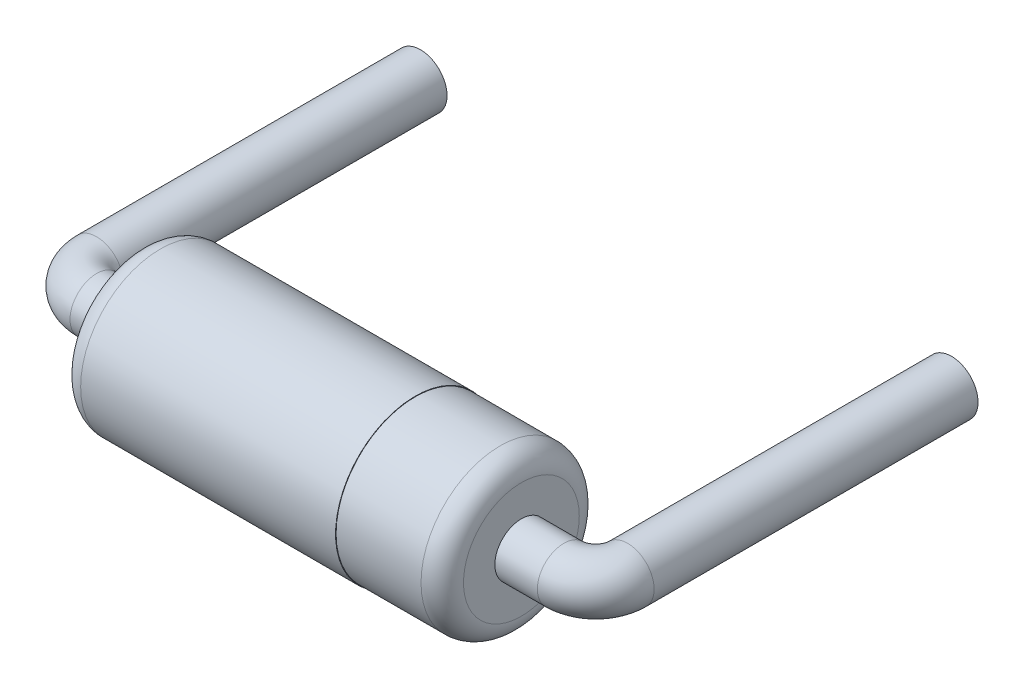
ISO-10303-21;
HEADER;
FILE_DESCRIPTION(('STEP AP214'),'2;1');
FILE_NAME('part.step','',(''),(''),'','','');
FILE_SCHEMA(('AUTOMOTIVE_DESIGN { 1 0 10303 214 1 1 1 1 }'));
ENDSEC;
DATA;
#1=APPLICATION_CONTEXT('core data for automotive mechanical design processes');
#2=APPLICATION_PROTOCOL_DEFINITION('international standard','automotive_design',2000,#1);
#3=PRODUCT_CONTEXT('',#1,'mechanical');
#4=PRODUCT('Part','Part','',(#3));
#5=PRODUCT_RELATED_PRODUCT_CATEGORY('part','',(#4));
#6=PRODUCT_DEFINITION_FORMATION('','',#4);
#7=PRODUCT_DEFINITION_CONTEXT('part definition',#1,'design');
#8=PRODUCT_DEFINITION('design','',#6,#7);
#9=PRODUCT_DEFINITION_SHAPE('','',#8);
#10=(LENGTH_UNIT() NAMED_UNIT(*) SI_UNIT(.MILLI.,.METRE.));
#11=(NAMED_UNIT(*) PLANE_ANGLE_UNIT() SI_UNIT($,.RADIAN.));
#12=(NAMED_UNIT(*) SI_UNIT($,.STERADIAN.) SOLID_ANGLE_UNIT());
#13=UNCERTAINTY_MEASURE_WITH_UNIT(LENGTH_MEASURE(1.E-05),#10,'distance_accuracy_value','');
#14=(GEOMETRIC_REPRESENTATION_CONTEXT(3) GLOBAL_UNCERTAINTY_ASSIGNED_CONTEXT((#13)) GLOBAL_UNIT_ASSIGNED_CONTEXT((#10,
#11,#12)) REPRESENTATION_CONTEXT('',''));
#15=CARTESIAN_POINT('',(0.,0.,0.));
#16=DIRECTION('',(0.,0.,1.));
#17=DIRECTION('',(1.,0.,0.));
#18=AXIS2_PLACEMENT_3D('',#15,#16,#17);
#19=CARTESIAN_POINT('',(2.5,0.,-3.35));
#20=DIRECTION('',(0.,0.,1.));
#21=DIRECTION('',(1.,0.,0.));
#22=AXIS2_PLACEMENT_3D('',#19,#20,#21);
#23=PLANE('',#22);
#24=CARTESIAN_POINT('',(2.5,0.,-3.35));
#25=DIRECTION('',(0.,0.,-1.));
#26=DIRECTION('',(-1.,0.,0.));
#27=AXIS2_PLACEMENT_3D('',#24,#25,#26);
#28=CIRCLE('',#27,0.25);
#29=CARTESIAN_POINT('',(2.25,0.,-3.35));
#30=VERTEX_POINT('',#29);
#31=EDGE_CURVE('E19',#30,#30,#28,.F.);
#32=ORIENTED_EDGE('',*,*,#31,.F.);
#33=EDGE_LOOP('',(#32));
#34=FACE_BOUND('',#33,.T.);
#35=ADVANCED_FACE('F15',(#34),#23,.F.);
#36=CARTESIAN_POINT('',(2.5,0.,-3.35));
#37=DIRECTION('',(0.,0.,-1.));
#38=DIRECTION('',(-1.,0.,0.));
#39=AXIS2_PLACEMENT_3D('',#36,#37,#38);
#40=CYLINDRICAL_SURFACE('',#39,0.25);
#41=ORIENTED_EDGE('',*,*,#31,.T.);
#42=EDGE_LOOP('',(#41));
#43=FACE_BOUND('',#42,.T.);
#44=CARTESIAN_POINT('',(2.5,0.,-0.3));
#45=DIRECTION('',(0.,0.,1.));
#46=DIRECTION('',(-1.,0.,0.));
#47=AXIS2_PLACEMENT_3D('',#44,#45,#46);
#48=CIRCLE('',#47,0.25);
#49=CARTESIAN_POINT('',(2.75,0.,-0.3));
#50=VERTEX_POINT('',#49);
#51=EDGE_CURVE('E32',#50,#50,#48,.T.);
#52=ORIENTED_EDGE('',*,*,#51,.F.);
#53=EDGE_LOOP('',(#52));
#54=FACE_BOUND('',#53,.T.);
#55=ADVANCED_FACE('F62',(#43,#54),#40,.T.);
#56=CARTESIAN_POINT('',(-2.5,0.,-3.35));
#57=DIRECTION('',(0.,0.,-1.));
#58=DIRECTION('',(-1.,0.,0.));
#59=AXIS2_PLACEMENT_3D('',#56,#57,#58);
#60=PLANE('',#59);
#61=CARTESIAN_POINT('',(-2.5,0.,-3.35));
#62=DIRECTION('',(0.,0.,1.));
#63=DIRECTION('',(1.,0.,0.));
#64=AXIS2_PLACEMENT_3D('',#61,#62,#63);
#65=CIRCLE('',#64,0.25);
#66=CARTESIAN_POINT('',(-2.25,0.,-3.35));
#67=VERTEX_POINT('',#66);
#68=EDGE_CURVE('E50',#67,#67,#65,.T.);
#69=ORIENTED_EDGE('',*,*,#68,.F.);
#70=EDGE_LOOP('',(#69));
#71=FACE_BOUND('',#70,.T.);
#72=ADVANCED_FACE('F71',(#71),#60,.T.);
#73=CARTESIAN_POINT('',(2.2,0.,-0.3));
#74=DIRECTION('',(0.,1.,0.));
#75=DIRECTION('',(0.,0.,1.));
#76=AXIS2_PLACEMENT_3D('',#73,#74,#75);
#77=TOROIDAL_SURFACE('',#76,0.3,0.25);
#78=CARTESIAN_POINT('',(2.2,0.,0.));
#79=DIRECTION('',(1.,0.,0.));
#80=DIRECTION('',(0.,0.,-1.));
#81=AXIS2_PLACEMENT_3D('',#78,#79,#80);
#82=CIRCLE('',#81,0.25);
#83=CARTESIAN_POINT('',(2.2,0.,0.25));
#84=VERTEX_POINT('',#83);
#85=EDGE_CURVE('E52',#84,#84,#82,.F.);
#86=CARTESIAN_POINT('',(2.2,0.,-0.3));
#87=DIRECTION('',(0.,1.,0.));
#88=DIRECTION('',(0.,0.,1.));
#89=AXIS2_PLACEMENT_3D('',#86,#87,#88);
#90=CIRCLE('',#89,0.55);
#91=EDGE_CURVE('',#84,#50,#90,.T.);
#92=ORIENTED_EDGE('',*,*,#85,.F.);
#93=ORIENTED_EDGE('',*,*,#51,.T.);
#94=ORIENTED_EDGE('',*,*,#91,.T.);
#95=ORIENTED_EDGE('',*,*,#91,.F.);
#96=EDGE_LOOP('',(#92,#94,#93,#95));
#97=FACE_BOUND('',#96,.T.);
#98=ADVANCED_FACE('F110',(#97),#77,.T.);
#99=CARTESIAN_POINT('',(-2.5,0.,-3.35));
#100=DIRECTION('',(0.,0.,1.));
#101=DIRECTION('',(1.,0.,0.));
#102=AXIS2_PLACEMENT_3D('',#99,#100,#101);
#103=CYLINDRICAL_SURFACE('',#102,0.25);
#104=ORIENTED_EDGE('',*,*,#68,.T.);
#105=EDGE_LOOP('',(#104));
#106=FACE_BOUND('',#105,.T.);
#107=CARTESIAN_POINT('',(-2.5,0.,-0.3));
#108=DIRECTION('',(0.,0.,1.));
#109=DIRECTION('',(-1.,0.,0.));
#110=AXIS2_PLACEMENT_3D('',#107,#108,#109);
#111=CIRCLE('',#110,0.25);
#112=CARTESIAN_POINT('',(-2.75,0.,-0.300000000000001));
#113=VERTEX_POINT('',#112);
#114=EDGE_CURVE('E49',#113,#113,#111,.T.);
#115=ORIENTED_EDGE('',*,*,#114,.F.);
#116=EDGE_LOOP('',(#115));
#117=FACE_BOUND('',#116,.T.);
#118=ADVANCED_FACE('F106',(#106,#117),#103,.T.);
#119=CARTESIAN_POINT('',(2.2,0.,0.));
#120=DIRECTION('',(1.,0.,0.));
#121=DIRECTION('',(0.,0.,-1.));
#122=AXIS2_PLACEMENT_3D('',#119,#120,#121);
#123=CYLINDRICAL_SURFACE('',#122,0.25);
#124=ORIENTED_EDGE('',*,*,#85,.T.);
#125=EDGE_LOOP('',(#124));
#126=FACE_BOUND('',#125,.T.);
#127=CARTESIAN_POINT('',(1.8,0.,0.));
#128=DIRECTION('',(1.,0.,0.));
#129=DIRECTION('',(0.,0.,-1.));
#130=AXIS2_PLACEMENT_3D('',#127,#128,#129);
#131=CIRCLE('',#130,0.25);
#132=CARTESIAN_POINT('',(1.8,0.,-0.250000000000002));
#133=VERTEX_POINT('',#132);
#134=EDGE_CURVE('E47',#133,#133,#131,.T.);
#135=ORIENTED_EDGE('',*,*,#134,.T.);
#136=EDGE_LOOP('',(#135));
#137=FACE_BOUND('',#136,.T.);
#138=ADVANCED_FACE('F103',(#126,#137),#123,.T.);
#139=CARTESIAN_POINT('',(-2.2,0.,-0.299999999999999));
#140=DIRECTION('',(0.,1.,0.));
#141=DIRECTION('',(0.,0.,1.));
#142=AXIS2_PLACEMENT_3D('',#139,#140,#141);
#143=TOROIDAL_SURFACE('',#142,0.3,0.25);
#144=CARTESIAN_POINT('',(-2.2,0.,0.));
#145=DIRECTION('',(1.,0.,0.));
#146=DIRECTION('',(0.,0.,-1.));
#147=AXIS2_PLACEMENT_3D('',#144,#145,#146);
#148=CIRCLE('',#147,0.25);
#149=CARTESIAN_POINT('',(-2.2,0.,0.25));
#150=VERTEX_POINT('',#149);
#151=EDGE_CURVE('E46',#150,#150,#148,.T.);
#152=CARTESIAN_POINT('',(-2.2,0.,-0.299999999999999));
#153=DIRECTION('',(0.,1.,0.));
#154=DIRECTION('',(0.,0.,1.));
#155=AXIS2_PLACEMENT_3D('',#152,#153,#154);
#156=CIRCLE('',#155,0.55);
#157=EDGE_CURVE('',#113,#150,#156,.T.);
#158=ORIENTED_EDGE('',*,*,#114,.T.);
#159=ORIENTED_EDGE('',*,*,#151,.F.);
#160=ORIENTED_EDGE('',*,*,#157,.T.);
#161=ORIENTED_EDGE('',*,*,#157,.F.);
#162=EDGE_LOOP('',(#158,#160,#159,#161));
#163=FACE_BOUND('',#162,.T.);
#164=ADVANCED_FACE('F101',(#163),#143,.T.);
#165=CARTESIAN_POINT('',(1.8,0.375,0.));
#166=DIRECTION('',(-1.,0.,0.));
#167=DIRECTION('',(0.,0.,1.));
#168=AXIS2_PLACEMENT_3D('',#165,#166,#167);
#169=PLANE('',#168);
#170=CARTESIAN_POINT('',(1.8,0.,0.));
#171=DIRECTION('',(1.,0.,0.));
#172=DIRECTION('',(0.,0.,-1.));
#173=AXIS2_PLACEMENT_3D('',#170,#171,#172);
#174=CIRCLE('',#173,0.545);
#175=CARTESIAN_POINT('',(1.8,0.,-0.545));
#176=VERTEX_POINT('',#175);
#177=EDGE_CURVE('E43',#176,#176,#174,.F.);
#178=ORIENTED_EDGE('',*,*,#177,.F.);
#179=EDGE_LOOP('',(#178));
#180=FACE_BOUND('',#179,.T.);
#181=ORIENTED_EDGE('',*,*,#134,.F.);
#182=EDGE_LOOP('',(#181));
#183=FACE_BOUND('',#182,.T.);
#184=ADVANCED_FACE('F97',(#180,#183),#169,.F.);
#185=CARTESIAN_POINT('',(-2.2,0.,0.));
#186=DIRECTION('',(1.,0.,0.));
#187=DIRECTION('',(0.,0.,-1.));
#188=AXIS2_PLACEMENT_3D('',#185,#186,#187);
#189=CYLINDRICAL_SURFACE('',#188,0.25);
#190=ORIENTED_EDGE('',*,*,#151,.T.);
#191=EDGE_LOOP('',(#190));
#192=FACE_BOUND('',#191,.T.);
#193=CARTESIAN_POINT('',(-1.8,0.,0.));
#194=DIRECTION('',(1.,0.,0.));
#195=DIRECTION('',(0.,0.,-1.));
#196=AXIS2_PLACEMENT_3D('',#193,#194,#195);
#197=CIRCLE('',#196,0.25);
#198=CARTESIAN_POINT('',(-1.8,0.,-0.250000000000002));
#199=VERTEX_POINT('',#198);
#200=EDGE_CURVE('E40',#199,#199,#197,.T.);
#201=ORIENTED_EDGE('',*,*,#200,.F.);
#202=EDGE_LOOP('',(#201));
#203=FACE_BOUND('',#202,.T.);
#204=ADVANCED_FACE('F94',(#192,#203),#189,.T.);
#205=CARTESIAN_POINT('',(1.6,0.,0.));
#206=DIRECTION('',(1.,0.,0.));
#207=DIRECTION('',(0.,0.,-1.));
#208=AXIS2_PLACEMENT_3D('',#205,#206,#207);
#209=TOROIDAL_SURFACE('',#208,0.545,0.2);
#210=CARTESIAN_POINT('',(1.6,0.,0.));
#211=DIRECTION('',(-1.,0.,0.));
#212=DIRECTION('',(0.,0.,1.));
#213=AXIS2_PLACEMENT_3D('',#210,#211,#212);
#214=CIRCLE('',#213,0.745);
#215=CARTESIAN_POINT('',(1.6,0.,0.745));
#216=VERTEX_POINT('',#215);
#217=EDGE_CURVE('E39',#216,#216,#214,.T.);
#218=ORIENTED_EDGE('',*,*,#217,.F.);
#219=EDGE_LOOP('',(#218));
#220=FACE_BOUND('',#219,.T.);
#221=ORIENTED_EDGE('',*,*,#177,.T.);
#222=EDGE_LOOP('',(#221));
#223=FACE_BOUND('',#222,.T.);
#224=ADVANCED_FACE('F92',(#220,#223),#209,.T.);
#225=CARTESIAN_POINT('',(-1.8,0.375,0.));
#226=DIRECTION('',(-1.,0.,0.));
#227=DIRECTION('',(0.,0.,1.));
#228=AXIS2_PLACEMENT_3D('',#225,#226,#227);
#229=PLANE('',#228);
#230=CARTESIAN_POINT('',(-1.8,0.,0.));
#231=DIRECTION('',(1.,0.,0.));
#232=DIRECTION('',(0.,1.,0.));
#233=AXIS2_PLACEMENT_3D('',#230,#231,#232);
#234=CIRCLE('',#233,0.55);
#235=CARTESIAN_POINT('',(-1.8,0.55,0.));
#236=VERTEX_POINT('',#235);
#237=EDGE_CURVE('E36',#236,#236,#234,.T.);
#238=ORIENTED_EDGE('',*,*,#237,.F.);
#239=EDGE_LOOP('',(#238));
#240=FACE_BOUND('',#239,.T.);
#241=ORIENTED_EDGE('',*,*,#200,.T.);
#242=EDGE_LOOP('',(#241));
#243=FACE_BOUND('',#242,.T.);
#244=ADVANCED_FACE('F88',(#240,#243),#229,.T.);
#245=CARTESIAN_POINT('',(1.8,0.,0.));
#246=DIRECTION('',(-1.,0.,0.));
#247=DIRECTION('',(0.,0.,1.));
#248=AXIS2_PLACEMENT_3D('',#245,#246,#247);
#249=CYLINDRICAL_SURFACE('',#248,0.745);
#250=ORIENTED_EDGE('',*,*,#217,.T.);
#251=EDGE_LOOP('',(#250));
#252=FACE_BOUND('',#251,.T.);
#253=CARTESIAN_POINT('',(0.8,0.,0.));
#254=DIRECTION('',(-1.,0.,0.));
#255=DIRECTION('',(0.,0.,1.));
#256=AXIS2_PLACEMENT_3D('',#253,#254,#255);
#257=CIRCLE('',#256,0.745);
#258=CARTESIAN_POINT('',(0.8,0.,0.745));
#259=VERTEX_POINT('',#258);
#260=EDGE_CURVE('E28',#259,#259,#257,.F.);
#261=ORIENTED_EDGE('',*,*,#260,.T.);
#262=EDGE_LOOP('',(#261));
#263=FACE_BOUND('',#262,.T.);
#264=ADVANCED_FACE('F85',(#252,#263),#249,.T.);
#265=CARTESIAN_POINT('',(-1.6,0.,0.));
#266=DIRECTION('',(1.,0.,0.));
#267=DIRECTION('',(0.,1.,0.));
#268=AXIS2_PLACEMENT_3D('',#265,#266,#267);
#269=TOROIDAL_SURFACE('',#268,0.55,0.2);
#270=CARTESIAN_POINT('',(-1.6,0.,0.));
#271=DIRECTION('',(1.,0.,0.));
#272=DIRECTION('',(0.,0.,-1.));
#273=AXIS2_PLACEMENT_3D('',#270,#271,#272);
#274=CIRCLE('',#273,0.75);
#275=CARTESIAN_POINT('',(-1.6,0.,-0.75));
#276=VERTEX_POINT('',#275);
#277=EDGE_CURVE('E23',#276,#276,#274,.T.);
#278=ORIENTED_EDGE('',*,*,#277,.F.);
#279=EDGE_LOOP('',(#278));
#280=FACE_BOUND('',#279,.T.);
#281=ORIENTED_EDGE('',*,*,#237,.T.);
#282=EDGE_LOOP('',(#281));
#283=FACE_BOUND('',#282,.T.);
#284=ADVANCED_FACE('F17',(#280,#283),#269,.T.);
#285=CARTESIAN_POINT('',(0.8,0.,0.));
#286=DIRECTION('',(-1.,0.,0.));
#287=DIRECTION('',(0.,0.,1.));
#288=AXIS2_PLACEMENT_3D('',#285,#286,#287);
#289=PLANE('',#288);
#290=CARTESIAN_POINT('',(0.8,0.,0.));
#291=DIRECTION('',(1.,0.,0.));
#292=DIRECTION('',(0.,0.,-1.));
#293=AXIS2_PLACEMENT_3D('',#290,#291,#292);
#294=CIRCLE('',#293,0.75);
#295=CARTESIAN_POINT('',(0.8,0.,-0.75));
#296=VERTEX_POINT('',#295);
#297=EDGE_CURVE('E10',#296,#296,#294,.F.);
#298=ORIENTED_EDGE('',*,*,#297,.F.);
#299=EDGE_LOOP('',(#298));
#300=FACE_BOUND('',#299,.T.);
#301=ORIENTED_EDGE('',*,*,#260,.F.);
#302=EDGE_LOOP('',(#301));
#303=FACE_BOUND('',#302,.T.);
#304=ADVANCED_FACE('F76',(#300,#303),#289,.F.);
#305=CARTESIAN_POINT('',(-0.9,0.,0.));
#306=DIRECTION('',(1.,0.,0.));
#307=DIRECTION('',(0.,0.,-1.));
#308=AXIS2_PLACEMENT_3D('',#305,#306,#307);
#309=CYLINDRICAL_SURFACE('',#308,0.75);
#310=ORIENTED_EDGE('',*,*,#297,.T.);
#311=EDGE_LOOP('',(#310));
#312=FACE_BOUND('',#311,.T.);
#313=ORIENTED_EDGE('',*,*,#277,.T.);
#314=EDGE_LOOP('',(#313));
#315=FACE_BOUND('',#314,.T.);
#316=ADVANCED_FACE('F74',(#312,#315),#309,.T.);
#317=CLOSED_SHELL('',(#35,#55,#72,#98,#118,#138,#164,#184,#204,#224,#244,#264,#284,#304,#316));
#318=MANIFOLD_SOLID_BREP('B1',#317);
#319=ADVANCED_BREP_SHAPE_REPRESENTATION('',(#18,#318),#14);
#320=SHAPE_DEFINITION_REPRESENTATION(#9,#319);
ENDSEC;
END-ISO-10303-21;
